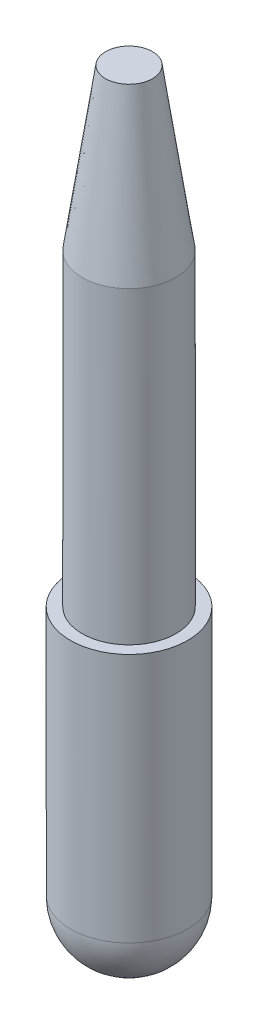
ISO-10303-21;
HEADER;
FILE_DESCRIPTION(('STEP AP214'),'2;1');
FILE_NAME('part.step','',(''),(''),'','','');
FILE_SCHEMA(('AUTOMOTIVE_DESIGN { 1 0 10303 214 1 1 1 1 }'));
ENDSEC;
DATA;
#1=APPLICATION_CONTEXT('core data for automotive mechanical design processes');
#2=APPLICATION_PROTOCOL_DEFINITION('international standard','automotive_design',2000,#1);
#3=PRODUCT_CONTEXT('',#1,'mechanical');
#4=PRODUCT('Part','Part','',(#3));
#5=PRODUCT_RELATED_PRODUCT_CATEGORY('part','',(#4));
#6=PRODUCT_DEFINITION_FORMATION('','',#4);
#7=PRODUCT_DEFINITION_CONTEXT('part definition',#1,'design');
#8=PRODUCT_DEFINITION('design','',#6,#7);
#9=PRODUCT_DEFINITION_SHAPE('','',#8);
#10=(LENGTH_UNIT() NAMED_UNIT(*) SI_UNIT(.MILLI.,.METRE.));
#11=(NAMED_UNIT(*) PLANE_ANGLE_UNIT() SI_UNIT($,.RADIAN.));
#12=(NAMED_UNIT(*) SI_UNIT($,.STERADIAN.) SOLID_ANGLE_UNIT());
#13=UNCERTAINTY_MEASURE_WITH_UNIT(LENGTH_MEASURE(1.E-05),#10,'distance_accuracy_value','');
#14=(GEOMETRIC_REPRESENTATION_CONTEXT(3) GLOBAL_UNCERTAINTY_ASSIGNED_CONTEXT((#13)) GLOBAL_UNIT_ASSIGNED_CONTEXT((#10,
#11,#12)) REPRESENTATION_CONTEXT('',''));
#15=CARTESIAN_POINT('',(0.,0.,0.));
#16=DIRECTION('',(0.,0.,1.));
#17=DIRECTION('',(1.,0.,0.));
#18=AXIS2_PLACEMENT_3D('',#15,#16,#17);
#19=CARTESIAN_POINT('',(0.,25.,0.));
#20=DIRECTION('',(0.,-1.,0.));
#21=DIRECTION('',(0.,0.,-1.));
#22=AXIS2_PLACEMENT_3D('',#19,#20,#21);
#23=CYLINDRICAL_SURFACE('',#22,3.8);
#24=CARTESIAN_POINT('',(0.,25.,0.));
#25=DIRECTION('',(0.,1.,0.));
#26=DIRECTION('',(0.,0.,1.));
#27=AXIS2_PLACEMENT_3D('',#24,#25,#26);
#28=CIRCLE('',#27,3.8);
#29=CARTESIAN_POINT('',(0.,25.,3.8));
#30=VERTEX_POINT('',#29);
#31=EDGE_CURVE('E10',#30,#30,#28,.T.);
#32=ORIENTED_EDGE('',*,*,#31,.F.);
#33=EDGE_LOOP('',(#32));
#34=FACE_BOUND('',#33,.T.);
#35=CARTESIAN_POINT('',(0.,0.,0.));
#36=DIRECTION('',(0.,-1.,0.));
#37=DIRECTION('',(0.,0.,-1.));
#38=AXIS2_PLACEMENT_3D('',#35,#36,#37);
#39=CIRCLE('',#38,3.8);
#40=CARTESIAN_POINT('',(0.,0.,-3.8));
#41=VERTEX_POINT('',#40);
#42=EDGE_CURVE('E38',#41,#41,#39,.T.);
#43=ORIENTED_EDGE('',*,*,#42,.F.);
#44=EDGE_LOOP('',(#43));
#45=FACE_BOUND('',#44,.T.);
#46=ADVANCED_FACE('F32',(#34,#45),#23,.T.);
#47=CARTESIAN_POINT('',(0.,0.,0.));
#48=DIRECTION('',(0.,-1.,0.));
#49=DIRECTION('',(0.,0.,-1.));
#50=AXIS2_PLACEMENT_3D('',#47,#48,#49);
#51=PLANE('',#50);
#52=CARTESIAN_POINT('',(0.,0.,0.));
#53=DIRECTION('',(0.,-1.,0.));
#54=DIRECTION('',(0.,0.,-1.));
#55=AXIS2_PLACEMENT_3D('',#52,#53,#54);
#56=CIRCLE('',#55,4.75);
#57=CARTESIAN_POINT('',(0.,0.,-4.75));
#58=VERTEX_POINT('',#57);
#59=EDGE_CURVE('E46',#58,#58,#56,.T.);
#60=ORIENTED_EDGE('',*,*,#59,.F.);
#61=EDGE_LOOP('',(#60));
#62=FACE_BOUND('',#61,.T.);
#63=ORIENTED_EDGE('',*,*,#42,.T.);
#64=EDGE_LOOP('',(#63));
#65=FACE_BOUND('',#64,.T.);
#66=ADVANCED_FACE('F70',(#62,#65),#51,.F.);
#67=CARTESIAN_POINT('',(0.,-20.25,0.));
#68=DIRECTION('',(0.,1.,0.));
#69=DIRECTION('',(0.,0.,1.));
#70=AXIS2_PLACEMENT_3D('',#67,#68,#69);
#71=CYLINDRICAL_SURFACE('',#70,4.75);
#72=CARTESIAN_POINT('',(0.,-20.25,0.));
#73=DIRECTION('',(0.,-1.,0.));
#74=DIRECTION('',(0.,0.,-1.));
#75=AXIS2_PLACEMENT_3D('',#72,#73,#74);
#76=CIRCLE('',#75,4.75);
#77=CARTESIAN_POINT('',(0.,-20.25,-4.75));
#78=VERTEX_POINT('',#77);
#79=EDGE_CURVE('E42',#78,#78,#76,.T.);
#80=ORIENTED_EDGE('',*,*,#79,.F.);
#81=EDGE_LOOP('',(#80));
#82=FACE_BOUND('',#81,.T.);
#83=ORIENTED_EDGE('',*,*,#59,.T.);
#84=EDGE_LOOP('',(#83));
#85=FACE_BOUND('',#84,.T.);
#86=ADVANCED_FACE('F66',(#82,#85),#71,.T.);
#87=CARTESIAN_POINT('',(0.,-20.25,0.));
#88=DIRECTION('',(0.,-1.,0.));
#89=DIRECTION('',(0.,0.,1.));
#90=AXIS2_PLACEMENT_3D('',#87,#88,#89);
#91=SPHERICAL_SURFACE('',#90,4.75);
#92=ORIENTED_EDGE('',*,*,#79,.T.);
#93=EDGE_LOOP('',(#92));
#94=FACE_BOUND('',#93,.T.);
#95=ADVANCED_FACE('F59',(#94),#91,.T.);
#96=CARTESIAN_POINT('',(0.,25.,0.));
#97=DIRECTION('',(0.,-1.,0.));
#98=DIRECTION('',(0.,0.,-1.));
#99=AXIS2_PLACEMENT_3D('',#96,#97,#98);
#100=CONICAL_SURFACE('',#99,3.8,0.145126322173404);
#101=CARTESIAN_POINT('',(0.,38.,0.));
#102=DIRECTION('',(0.,1.,0.));
#103=DIRECTION('',(0.,0.,1.));
#104=AXIS2_PLACEMENT_3D('',#101,#102,#103);
#105=CIRCLE('',#104,1.9);
#106=CARTESIAN_POINT('',(0.,38.,1.9));
#107=VERTEX_POINT('',#106);
#108=EDGE_CURVE('E51',#107,#107,#105,.T.);
#109=ORIENTED_EDGE('',*,*,#108,.F.);
#110=EDGE_LOOP('',(#109));
#111=FACE_BOUND('',#110,.T.);
#112=ORIENTED_EDGE('',*,*,#31,.T.);
#113=EDGE_LOOP('',(#112));
#114=FACE_BOUND('',#113,.T.);
#115=ADVANCED_FACE('F57',(#111,#114),#100,.T.);
#116=CARTESIAN_POINT('',(0.,38.,-1.9));
#117=DIRECTION('',(0.,-1.,0.));
#118=DIRECTION('',(0.,0.,-1.));
#119=AXIS2_PLACEMENT_3D('',#116,#117,#118);
#120=PLANE('',#119);
#121=ORIENTED_EDGE('',*,*,#108,.T.);
#122=EDGE_LOOP('',(#121));
#123=FACE_BOUND('',#122,.T.);
#124=ADVANCED_FACE('F55',(#123),#120,.F.);
#125=CLOSED_SHELL('',(#46,#66,#86,#95,#115,#124));
#126=MANIFOLD_SOLID_BREP('B2',#125);
#127=ADVANCED_BREP_SHAPE_REPRESENTATION('',(#18,#126),#14);
#128=SHAPE_DEFINITION_REPRESENTATION(#9,#127);
ENDSEC;
END-ISO-10303-21;
